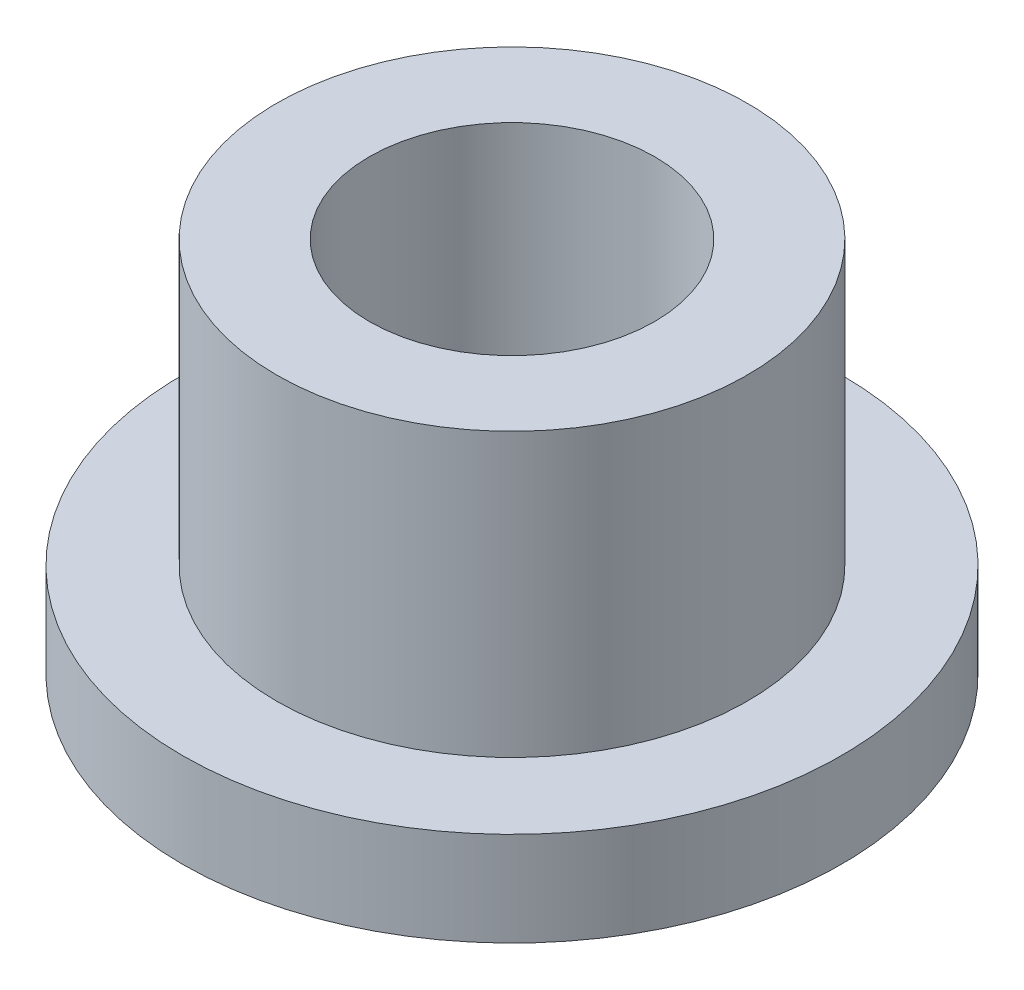
ISO-10303-21;
HEADER;
FILE_DESCRIPTION(('STEP AP214'),'2;1');
FILE_NAME('part.step','',(''),(''),'','','');
FILE_SCHEMA(('AUTOMOTIVE_DESIGN { 1 0 10303 214 1 1 1 1 }'));
ENDSEC;
DATA;
#1=APPLICATION_CONTEXT('core data for automotive mechanical design processes');
#2=APPLICATION_PROTOCOL_DEFINITION('international standard','automotive_design',2000,#1);
#3=PRODUCT_CONTEXT('',#1,'mechanical');
#4=PRODUCT('Part','Part','',(#3));
#5=PRODUCT_RELATED_PRODUCT_CATEGORY('part','',(#4));
#6=PRODUCT_DEFINITION_FORMATION('','',#4);
#7=PRODUCT_DEFINITION_CONTEXT('part definition',#1,'design');
#8=PRODUCT_DEFINITION('design','',#6,#7);
#9=PRODUCT_DEFINITION_SHAPE('','',#8);
#10=(LENGTH_UNIT() NAMED_UNIT(*) SI_UNIT(.MILLI.,.METRE.));
#11=(NAMED_UNIT(*) PLANE_ANGLE_UNIT() SI_UNIT($,.RADIAN.));
#12=(NAMED_UNIT(*) SI_UNIT($,.STERADIAN.) SOLID_ANGLE_UNIT());
#13=UNCERTAINTY_MEASURE_WITH_UNIT(LENGTH_MEASURE(1.E-05),#10,'distance_accuracy_value','');
#14=(GEOMETRIC_REPRESENTATION_CONTEXT(3) GLOBAL_UNCERTAINTY_ASSIGNED_CONTEXT((#13)) GLOBAL_UNIT_ASSIGNED_CONTEXT((#10,
#11,#12)) REPRESENTATION_CONTEXT('',''));
#15=CARTESIAN_POINT('',(0.,0.,0.));
#16=DIRECTION('',(0.,0.,1.));
#17=DIRECTION('',(1.,0.,0.));
#18=AXIS2_PLACEMENT_3D('',#15,#16,#17);
#19=CARTESIAN_POINT('',(0.,12.7,0.));
#20=DIRECTION('',(0.,1.,0.));
#21=DIRECTION('',(0.,0.,1.));
#22=AXIS2_PLACEMENT_3D('',#19,#20,#21);
#23=PLANE('',#22);
#24=CARTESIAN_POINT('',(0.,12.7,0.));
#25=DIRECTION('',(0.,1.,0.));
#26=DIRECTION('',(0.,0.,1.));
#27=AXIS2_PLACEMENT_3D('',#24,#25,#26);
#28=CIRCLE('',#27,7.9375);
#29=CARTESIAN_POINT('',(0.,12.7,7.9375));
#30=VERTEX_POINT('',#29);
#31=EDGE_CURVE('E10',#30,#30,#28,.T.);
#32=ORIENTED_EDGE('',*,*,#31,.T.);
#33=EDGE_LOOP('',(#32));
#34=FACE_BOUND('',#33,.T.);
#35=CARTESIAN_POINT('',(0.,12.7,0.));
#36=DIRECTION('',(0.,1.,0.));
#37=DIRECTION('',(0.,0.,1.));
#38=AXIS2_PLACEMENT_3D('',#35,#36,#37);
#39=CIRCLE('',#38,4.8133);
#40=CARTESIAN_POINT('',(0.,12.7,4.8133));
#41=VERTEX_POINT('',#40);
#42=EDGE_CURVE('E37',#41,#41,#39,.T.);
#43=ORIENTED_EDGE('',*,*,#42,.F.);
#44=EDGE_LOOP('',(#43));
#45=FACE_BOUND('',#44,.T.);
#46=ADVANCED_FACE('F30',(#34,#45),#23,.T.);
#47=CARTESIAN_POINT('',(0.,0.,0.));
#48=DIRECTION('',(0.,1.,0.));
#49=DIRECTION('',(0.,0.,1.));
#50=AXIS2_PLACEMENT_3D('',#47,#48,#49);
#51=PLANE('',#50);
#52=CARTESIAN_POINT('',(0.,0.,0.));
#53=DIRECTION('',(0.,1.,0.));
#54=DIRECTION('',(0.,0.,1.));
#55=AXIS2_PLACEMENT_3D('',#52,#53,#54);
#56=CIRCLE('',#55,4.8133);
#57=CARTESIAN_POINT('',(0.,0.,4.8133));
#58=VERTEX_POINT('',#57);
#59=EDGE_CURVE('E41',#58,#58,#56,.T.);
#60=ORIENTED_EDGE('',*,*,#59,.T.);
#61=EDGE_LOOP('',(#60));
#62=FACE_BOUND('',#61,.T.);
#63=CARTESIAN_POINT('',(0.,0.,0.));
#64=DIRECTION('',(0.,1.,0.));
#65=DIRECTION('',(0.,0.,1.));
#66=AXIS2_PLACEMENT_3D('',#63,#64,#65);
#67=CIRCLE('',#66,11.1125);
#68=CARTESIAN_POINT('',(0.,0.,11.1125));
#69=VERTEX_POINT('',#68);
#70=EDGE_CURVE('E48',#69,#69,#67,.T.);
#71=ORIENTED_EDGE('',*,*,#70,.F.);
#72=EDGE_LOOP('',(#71));
#73=FACE_BOUND('',#72,.T.);
#74=ADVANCED_FACE('F73',(#62,#73),#51,.F.);
#75=CARTESIAN_POINT('',(0.,12.7,0.));
#76=DIRECTION('',(0.,-1.,0.));
#77=DIRECTION('',(0.,0.,-1.));
#78=AXIS2_PLACEMENT_3D('',#75,#76,#77);
#79=CYLINDRICAL_SURFACE('',#78,7.9375);
#80=CARTESIAN_POINT('',(0.,3.175,0.));
#81=DIRECTION('',(0.,1.,0.));
#82=DIRECTION('',(0.,0.,1.));
#83=AXIS2_PLACEMENT_3D('',#80,#81,#82);
#84=CIRCLE('',#83,7.9375);
#85=CARTESIAN_POINT('',(0.,3.175,7.9375));
#86=VERTEX_POINT('',#85);
#87=EDGE_CURVE('E51',#86,#86,#84,.T.);
#88=ORIENTED_EDGE('',*,*,#87,.T.);
#89=EDGE_LOOP('',(#88));
#90=FACE_BOUND('',#89,.T.);
#91=ORIENTED_EDGE('',*,*,#31,.F.);
#92=EDGE_LOOP('',(#91));
#93=FACE_BOUND('',#92,.T.);
#94=ADVANCED_FACE('F32',(#90,#93),#79,.T.);
#95=CARTESIAN_POINT('',(0.,12.7,0.));
#96=DIRECTION('',(0.,-1.,0.));
#97=DIRECTION('',(0.,0.,-1.));
#98=AXIS2_PLACEMENT_3D('',#95,#96,#97);
#99=CYLINDRICAL_SURFACE('',#98,4.8133);
#100=ORIENTED_EDGE('',*,*,#42,.T.);
#101=EDGE_LOOP('',(#100));
#102=FACE_BOUND('',#101,.T.);
#103=ORIENTED_EDGE('',*,*,#59,.F.);
#104=EDGE_LOOP('',(#103));
#105=FACE_BOUND('',#104,.T.);
#106=ADVANCED_FACE('F62',(#102,#105),#99,.F.);
#107=CARTESIAN_POINT('',(0.,3.175,0.));
#108=DIRECTION('',(0.,1.,0.));
#109=DIRECTION('',(0.,0.,1.));
#110=AXIS2_PLACEMENT_3D('',#107,#108,#109);
#111=PLANE('',#110);
#112=CARTESIAN_POINT('',(0.,3.175,0.));
#113=DIRECTION('',(0.,1.,0.));
#114=DIRECTION('',(0.,0.,1.));
#115=AXIS2_PLACEMENT_3D('',#112,#113,#114);
#116=CIRCLE('',#115,11.1125);
#117=CARTESIAN_POINT('',(0.,3.175,11.1125));
#118=VERTEX_POINT('',#117);
#119=EDGE_CURVE('E46',#118,#118,#116,.T.);
#120=ORIENTED_EDGE('',*,*,#119,.T.);
#121=EDGE_LOOP('',(#120));
#122=FACE_BOUND('',#121,.T.);
#123=ORIENTED_EDGE('',*,*,#87,.F.);
#124=EDGE_LOOP('',(#123));
#125=FACE_BOUND('',#124,.T.);
#126=ADVANCED_FACE('F59',(#122,#125),#111,.T.);
#127=CARTESIAN_POINT('',(0.,3.175,0.));
#128=DIRECTION('',(0.,-1.,0.));
#129=DIRECTION('',(0.,0.,-1.));
#130=AXIS2_PLACEMENT_3D('',#127,#128,#129);
#131=CYLINDRICAL_SURFACE('',#130,11.1125);
#132=ORIENTED_EDGE('',*,*,#119,.F.);
#133=EDGE_LOOP('',(#132));
#134=FACE_BOUND('',#133,.T.);
#135=ORIENTED_EDGE('',*,*,#70,.T.);
#136=EDGE_LOOP('',(#135));
#137=FACE_BOUND('',#136,.T.);
#138=ADVANCED_FACE('F61',(#134,#137),#131,.T.);
#139=CLOSED_SHELL('',(#46,#74,#94,#106,#126,#138));
#140=MANIFOLD_SOLID_BREP('B2',#139);
#141=ADVANCED_BREP_SHAPE_REPRESENTATION('',(#18,#140),#14);
#142=SHAPE_DEFINITION_REPRESENTATION(#9,#141);
ENDSEC;
END-ISO-10303-21;
